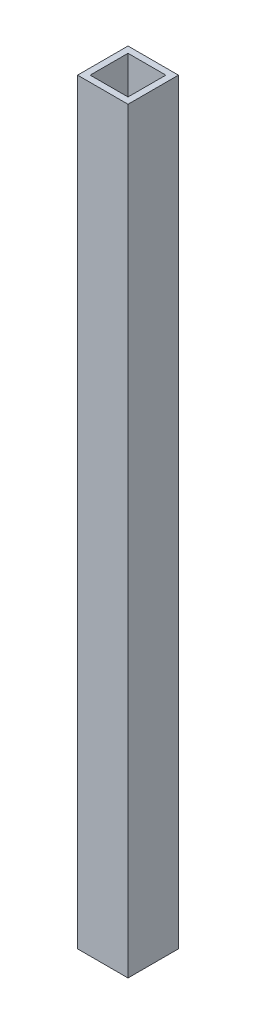
ISO-10303-21;
HEADER;
FILE_DESCRIPTION(('STEP AP214'),'2;1');
FILE_NAME('part.step','',(''),(''),'','','');
FILE_SCHEMA(('AUTOMOTIVE_DESIGN { 1 0 10303 214 1 1 1 1 }'));
ENDSEC;
DATA;
#1=APPLICATION_CONTEXT('core data for automotive mechanical design processes');
#2=APPLICATION_PROTOCOL_DEFINITION('international standard','automotive_design',2000,#1);
#3=PRODUCT_CONTEXT('',#1,'mechanical');
#4=PRODUCT('Part','Part','',(#3));
#5=PRODUCT_RELATED_PRODUCT_CATEGORY('part','',(#4));
#6=PRODUCT_DEFINITION_FORMATION('','',#4);
#7=PRODUCT_DEFINITION_CONTEXT('part definition',#1,'design');
#8=PRODUCT_DEFINITION('design','',#6,#7);
#9=PRODUCT_DEFINITION_SHAPE('','',#8);
#10=(LENGTH_UNIT() NAMED_UNIT(*) SI_UNIT(.MILLI.,.METRE.));
#11=(NAMED_UNIT(*) PLANE_ANGLE_UNIT() SI_UNIT($,.RADIAN.));
#12=(NAMED_UNIT(*) SI_UNIT($,.STERADIAN.) SOLID_ANGLE_UNIT());
#13=UNCERTAINTY_MEASURE_WITH_UNIT(LENGTH_MEASURE(1.E-05),#10,'distance_accuracy_value','');
#14=(GEOMETRIC_REPRESENTATION_CONTEXT(3) GLOBAL_UNCERTAINTY_ASSIGNED_CONTEXT((#13)) GLOBAL_UNIT_ASSIGNED_CONTEXT((#10,
#11,#12)) REPRESENTATION_CONTEXT('',''));
#15=CARTESIAN_POINT('',(0.,0.,0.));
#16=DIRECTION('',(0.,0.,1.));
#17=DIRECTION('',(1.,0.,0.));
#18=AXIS2_PLACEMENT_3D('',#15,#16,#17);
#19=CARTESIAN_POINT('',(12.7,381.,-12.7));
#20=DIRECTION('',(-1.,0.,0.));
#21=DIRECTION('',(0.,0.,1.));
#22=AXIS2_PLACEMENT_3D('',#19,#20,#21);
#23=PLANE('',#22);
#24=DIRECTION('',(0.,0.,-1.));
#25=VECTOR('',#24,1.);
#26=CARTESIAN_POINT('',(12.7,0.,-12.7));
#27=LINE('',#26,#25);
#28=CARTESIAN_POINT('',(12.7,0.,12.7));
#29=VERTEX_POINT('',#28);
#30=CARTESIAN_POINT('',(12.7,0.,-12.7));
#31=VERTEX_POINT('',#30);
#32=EDGE_CURVE('E152',#29,#31,#27,.T.);
#33=ORIENTED_EDGE('',*,*,#32,.T.);
#34=DIRECTION('',(0.,-1.,0.));
#35=VECTOR('',#34,1.);
#36=CARTESIAN_POINT('',(12.7,381.,-12.7));
#37=LINE('',#36,#35);
#38=CARTESIAN_POINT('',(12.7,381.,-12.7));
#39=VERTEX_POINT('',#38);
#40=EDGE_CURVE('E11',#39,#31,#37,.T.);
#41=ORIENTED_EDGE('',*,*,#40,.F.);
#42=DIRECTION('',(0.,0.,-1.));
#43=VECTOR('',#42,1.);
#44=CARTESIAN_POINT('',(12.7,381.,-12.7));
#45=LINE('',#44,#43);
#46=CARTESIAN_POINT('',(12.7,381.,12.7));
#47=VERTEX_POINT('',#46);
#48=EDGE_CURVE('E153',#47,#39,#45,.T.);
#49=ORIENTED_EDGE('',*,*,#48,.F.);
#50=DIRECTION('',(0.,-1.,0.));
#51=VECTOR('',#50,1.);
#52=CARTESIAN_POINT('',(12.7,381.,12.7));
#53=LINE('',#52,#51);
#54=EDGE_CURVE('E167',#47,#29,#53,.T.);
#55=ORIENTED_EDGE('',*,*,#54,.T.);
#56=EDGE_LOOP('',(#33,#41,#49,#55));
#57=FACE_BOUND('',#56,.T.);
#58=ADVANCED_FACE('F39',(#57),#23,.F.);
#59=CARTESIAN_POINT('',(-12.7,381.,-12.7));
#60=DIRECTION('',(0.,0.,1.));
#61=DIRECTION('',(1.,0.,0.));
#62=AXIS2_PLACEMENT_3D('',#59,#60,#61);
#63=PLANE('',#62);
#64=DIRECTION('',(-1.,0.,0.));
#65=VECTOR('',#64,1.);
#66=CARTESIAN_POINT('',(-12.7,0.,-12.7));
#67=LINE('',#66,#65);
#68=CARTESIAN_POINT('',(-12.7,0.,-12.7));
#69=VERTEX_POINT('',#68);
#70=EDGE_CURVE('E171',#31,#69,#67,.T.);
#71=ORIENTED_EDGE('',*,*,#70,.T.);
#72=DIRECTION('',(0.,-1.,0.));
#73=VECTOR('',#72,1.);
#74=CARTESIAN_POINT('',(-12.7,381.,-12.7));
#75=LINE('',#74,#73);
#76=CARTESIAN_POINT('',(-12.7,381.,-12.7));
#77=VERTEX_POINT('',#76);
#78=EDGE_CURVE('E47',#77,#69,#75,.T.);
#79=ORIENTED_EDGE('',*,*,#78,.F.);
#80=DIRECTION('',(-1.,0.,0.));
#81=VECTOR('',#80,1.);
#82=CARTESIAN_POINT('',(-12.7,381.,-12.7));
#83=LINE('',#82,#81);
#84=EDGE_CURVE('E157',#39,#77,#83,.T.);
#85=ORIENTED_EDGE('',*,*,#84,.F.);
#86=ORIENTED_EDGE('',*,*,#40,.T.);
#87=EDGE_LOOP('',(#71,#79,#85,#86));
#88=FACE_BOUND('',#87,.T.);
#89=ADVANCED_FACE('F205',(#88),#63,.F.);
#90=CARTESIAN_POINT('',(-12.7,381.,-12.7));
#91=DIRECTION('',(1.,0.,0.));
#92=DIRECTION('',(0.,0.,-1.));
#93=AXIS2_PLACEMENT_3D('',#90,#91,#92);
#94=PLANE('',#93);
#95=DIRECTION('',(0.,0.,1.));
#96=VECTOR('',#95,1.);
#97=CARTESIAN_POINT('',(-12.7,0.,-12.7));
#98=LINE('',#97,#96);
#99=CARTESIAN_POINT('',(-12.7,0.,12.7));
#100=VERTEX_POINT('',#99);
#101=EDGE_CURVE('E174',#69,#100,#98,.T.);
#102=ORIENTED_EDGE('',*,*,#101,.T.);
#103=DIRECTION('',(0.,-1.,0.));
#104=VECTOR('',#103,1.);
#105=CARTESIAN_POINT('',(-12.7,381.,12.7));
#106=LINE('',#105,#104);
#107=CARTESIAN_POINT('',(-12.7,381.,12.7));
#108=VERTEX_POINT('',#107);
#109=EDGE_CURVE('E182',#108,#100,#106,.T.);
#110=ORIENTED_EDGE('',*,*,#109,.F.);
#111=DIRECTION('',(0.,0.,1.));
#112=VECTOR('',#111,1.);
#113=CARTESIAN_POINT('',(-12.7,381.,-12.7));
#114=LINE('',#113,#112);
#115=EDGE_CURVE('E161',#77,#108,#114,.T.);
#116=ORIENTED_EDGE('',*,*,#115,.F.);
#117=ORIENTED_EDGE('',*,*,#78,.T.);
#118=EDGE_LOOP('',(#102,#110,#116,#117));
#119=FACE_BOUND('',#118,.T.);
#120=ADVANCED_FACE('F191',(#119),#94,.F.);
#121=CARTESIAN_POINT('',(-12.7,381.,12.7));
#122=DIRECTION('',(0.,0.,-1.));
#123=DIRECTION('',(-1.,0.,0.));
#124=AXIS2_PLACEMENT_3D('',#121,#122,#123);
#125=PLANE('',#124);
#126=DIRECTION('',(1.,0.,0.));
#127=VECTOR('',#126,1.);
#128=CARTESIAN_POINT('',(-12.7,0.,12.7));
#129=LINE('',#128,#127);
#130=EDGE_CURVE('E158',#100,#29,#129,.T.);
#131=ORIENTED_EDGE('',*,*,#130,.T.);
#132=ORIENTED_EDGE('',*,*,#54,.F.);
#133=DIRECTION('',(1.,0.,0.));
#134=VECTOR('',#133,1.);
#135=CARTESIAN_POINT('',(-12.7,381.,12.7));
#136=LINE('',#135,#134);
#137=EDGE_CURVE('E164',#108,#47,#136,.T.);
#138=ORIENTED_EDGE('',*,*,#137,.F.);
#139=ORIENTED_EDGE('',*,*,#109,.T.);
#140=EDGE_LOOP('',(#131,#132,#138,#139));
#141=FACE_BOUND('',#140,.T.);
#142=ADVANCED_FACE('F198',(#141),#125,.F.);
#143=CARTESIAN_POINT('',(0.,381.,0.));
#144=DIRECTION('',(0.,1.,0.));
#145=DIRECTION('',(0.,0.,1.));
#146=AXIS2_PLACEMENT_3D('',#143,#144,#145);
#147=PLANE('',#146);
#148=DIRECTION('',(0.,0.,-1.));
#149=VECTOR('',#148,1.);
#150=CARTESIAN_POINT('',(9.525,381.,0.));
#151=LINE('',#150,#149);
#152=CARTESIAN_POINT('',(9.525,381.,9.525));
#153=VERTEX_POINT('',#152);
#154=CARTESIAN_POINT('',(9.525,381.,-9.525));
#155=VERTEX_POINT('',#154);
#156=EDGE_CURVE('E110',#153,#155,#151,.T.);
#157=ORIENTED_EDGE('',*,*,#156,.F.);
#158=DIRECTION('',(1.,0.,0.));
#159=VECTOR('',#158,1.);
#160=CARTESIAN_POINT('',(0.,381.,9.525));
#161=LINE('',#160,#159);
#162=CARTESIAN_POINT('',(-9.525,381.,9.525));
#163=VERTEX_POINT('',#162);
#164=EDGE_CURVE('E147',#163,#153,#161,.T.);
#165=ORIENTED_EDGE('',*,*,#164,.F.);
#166=DIRECTION('',(0.,0.,1.));
#167=VECTOR('',#166,1.);
#168=CARTESIAN_POINT('',(-9.525,381.,0.));
#169=LINE('',#168,#167);
#170=CARTESIAN_POINT('',(-9.525,381.,-9.525));
#171=VERTEX_POINT('',#170);
#172=EDGE_CURVE('E144',#171,#163,#169,.T.);
#173=ORIENTED_EDGE('',*,*,#172,.F.);
#174=DIRECTION('',(-1.,0.,0.));
#175=VECTOR('',#174,1.);
#176=CARTESIAN_POINT('',(0.,381.,-9.525));
#177=LINE('',#176,#175);
#178=EDGE_CURVE('E135',#155,#171,#177,.T.);
#179=ORIENTED_EDGE('',*,*,#178,.F.);
#180=EDGE_LOOP('',(#157,#165,#173,#179));
#181=FACE_BOUND('',#180,.T.);
#182=ORIENTED_EDGE('',*,*,#48,.T.);
#183=ORIENTED_EDGE('',*,*,#84,.T.);
#184=ORIENTED_EDGE('',*,*,#115,.T.);
#185=ORIENTED_EDGE('',*,*,#137,.T.);
#186=EDGE_LOOP('',(#182,#183,#184,#185));
#187=FACE_BOUND('',#186,.T.);
#188=ADVANCED_FACE('F204',(#181,#187),#147,.T.);
#189=CARTESIAN_POINT('',(0.,0.,0.));
#190=DIRECTION('',(0.,1.,0.));
#191=DIRECTION('',(0.,0.,1.));
#192=AXIS2_PLACEMENT_3D('',#189,#190,#191);
#193=PLANE('',#192);
#194=DIRECTION('',(1.,0.,0.));
#195=VECTOR('',#194,1.);
#196=CARTESIAN_POINT('',(-9.525,0.,9.525));
#197=LINE('',#196,#195);
#198=CARTESIAN_POINT('',(-9.525,0.,9.525));
#199=VERTEX_POINT('',#198);
#200=CARTESIAN_POINT('',(9.525,0.,9.525));
#201=VERTEX_POINT('',#200);
#202=EDGE_CURVE('E114',#199,#201,#197,.T.);
#203=ORIENTED_EDGE('',*,*,#202,.T.);
#204=DIRECTION('',(0.,0.,-1.));
#205=VECTOR('',#204,1.);
#206=CARTESIAN_POINT('',(9.525,0.,-9.525));
#207=LINE('',#206,#205);
#208=CARTESIAN_POINT('',(9.525,0.,-9.525));
#209=VERTEX_POINT('',#208);
#210=EDGE_CURVE('E107',#201,#209,#207,.T.);
#211=ORIENTED_EDGE('',*,*,#210,.T.);
#212=DIRECTION('',(-1.,0.,0.));
#213=VECTOR('',#212,1.);
#214=CARTESIAN_POINT('',(-9.525,0.,-9.525));
#215=LINE('',#214,#213);
#216=CARTESIAN_POINT('',(-9.525,0.,-9.525));
#217=VERTEX_POINT('',#216);
#218=EDGE_CURVE('E117',#209,#217,#215,.T.);
#219=ORIENTED_EDGE('',*,*,#218,.T.);
#220=DIRECTION('',(0.,0.,1.));
#221=VECTOR('',#220,1.);
#222=CARTESIAN_POINT('',(-9.525,0.,-9.525));
#223=LINE('',#222,#221);
#224=EDGE_CURVE('E62',#217,#199,#223,.T.);
#225=ORIENTED_EDGE('',*,*,#224,.T.);
#226=EDGE_LOOP('',(#203,#211,#219,#225));
#227=FACE_BOUND('',#226,.T.);
#228=ORIENTED_EDGE('',*,*,#32,.F.);
#229=ORIENTED_EDGE('',*,*,#130,.F.);
#230=ORIENTED_EDGE('',*,*,#101,.F.);
#231=ORIENTED_EDGE('',*,*,#70,.F.);
#232=EDGE_LOOP('',(#228,#229,#230,#231));
#233=FACE_BOUND('',#232,.T.);
#234=ADVANCED_FACE('F122',(#227,#233),#193,.F.);
#235=CARTESIAN_POINT('',(9.525,0.,-9.525));
#236=DIRECTION('',(1.,0.,0.));
#237=DIRECTION('',(0.,0.,-1.));
#238=AXIS2_PLACEMENT_3D('',#235,#236,#237);
#239=PLANE('',#238);
#240=ORIENTED_EDGE('',*,*,#156,.T.);
#241=DIRECTION('',(0.,1.,0.));
#242=VECTOR('',#241,1.);
#243=CARTESIAN_POINT('',(9.525,0.,-9.525));
#244=LINE('',#243,#242);
#245=EDGE_CURVE('E54',#209,#155,#244,.T.);
#246=ORIENTED_EDGE('',*,*,#245,.F.);
#247=ORIENTED_EDGE('',*,*,#210,.F.);
#248=DIRECTION('',(0.,1.,0.));
#249=VECTOR('',#248,1.);
#250=CARTESIAN_POINT('',(9.525,0.,9.525));
#251=LINE('',#250,#249);
#252=EDGE_CURVE('E132',#201,#153,#251,.T.);
#253=ORIENTED_EDGE('',*,*,#252,.T.);
#254=EDGE_LOOP('',(#240,#246,#247,#253));
#255=FACE_BOUND('',#254,.T.);
#256=ADVANCED_FACE('F104',(#255),#239,.F.);
#257=CARTESIAN_POINT('',(-9.525,0.,9.525));
#258=DIRECTION('',(0.,0.,1.));
#259=DIRECTION('',(1.,0.,0.));
#260=AXIS2_PLACEMENT_3D('',#257,#258,#259);
#261=PLANE('',#260);
#262=ORIENTED_EDGE('',*,*,#164,.T.);
#263=ORIENTED_EDGE('',*,*,#252,.F.);
#264=ORIENTED_EDGE('',*,*,#202,.F.);
#265=DIRECTION('',(0.,1.,0.));
#266=VECTOR('',#265,1.);
#267=CARTESIAN_POINT('',(-9.525,0.,9.525));
#268=LINE('',#267,#266);
#269=EDGE_CURVE('E136',#199,#163,#268,.T.);
#270=ORIENTED_EDGE('',*,*,#269,.T.);
#271=EDGE_LOOP('',(#262,#263,#264,#270));
#272=FACE_BOUND('',#271,.T.);
#273=ADVANCED_FACE('F222',(#272),#261,.F.);
#274=CARTESIAN_POINT('',(-9.525,0.,-9.525));
#275=DIRECTION('',(-1.,0.,0.));
#276=DIRECTION('',(0.,0.,1.));
#277=AXIS2_PLACEMENT_3D('',#274,#275,#276);
#278=PLANE('',#277);
#279=ORIENTED_EDGE('',*,*,#172,.T.);
#280=ORIENTED_EDGE('',*,*,#269,.F.);
#281=ORIENTED_EDGE('',*,*,#224,.F.);
#282=DIRECTION('',(0.,1.,0.));
#283=VECTOR('',#282,1.);
#284=CARTESIAN_POINT('',(-9.525,0.,-9.525));
#285=LINE('',#284,#283);
#286=EDGE_CURVE('E113',#217,#171,#285,.T.);
#287=ORIENTED_EDGE('',*,*,#286,.T.);
#288=EDGE_LOOP('',(#279,#280,#281,#287));
#289=FACE_BOUND('',#288,.T.);
#290=ADVANCED_FACE('F225',(#289),#278,.F.);
#291=CARTESIAN_POINT('',(-9.525,0.,-9.525));
#292=DIRECTION('',(0.,0.,-1.));
#293=DIRECTION('',(-1.,0.,0.));
#294=AXIS2_PLACEMENT_3D('',#291,#292,#293);
#295=PLANE('',#294);
#296=ORIENTED_EDGE('',*,*,#178,.T.);
#297=ORIENTED_EDGE('',*,*,#286,.F.);
#298=ORIENTED_EDGE('',*,*,#218,.F.);
#299=ORIENTED_EDGE('',*,*,#245,.T.);
#300=EDGE_LOOP('',(#296,#297,#298,#299));
#301=FACE_BOUND('',#300,.T.);
#302=ADVANCED_FACE('F118',(#301),#295,.F.);
#303=CLOSED_SHELL('',(#58,#89,#120,#142,#188,#234,#256,#273,#290,#302));
#304=MANIFOLD_SOLID_BREP('B2',#303);
#305=ADVANCED_BREP_SHAPE_REPRESENTATION('',(#18,#304),#14);
#306=SHAPE_DEFINITION_REPRESENTATION(#9,#305);
ENDSEC;
END-ISO-10303-21;
